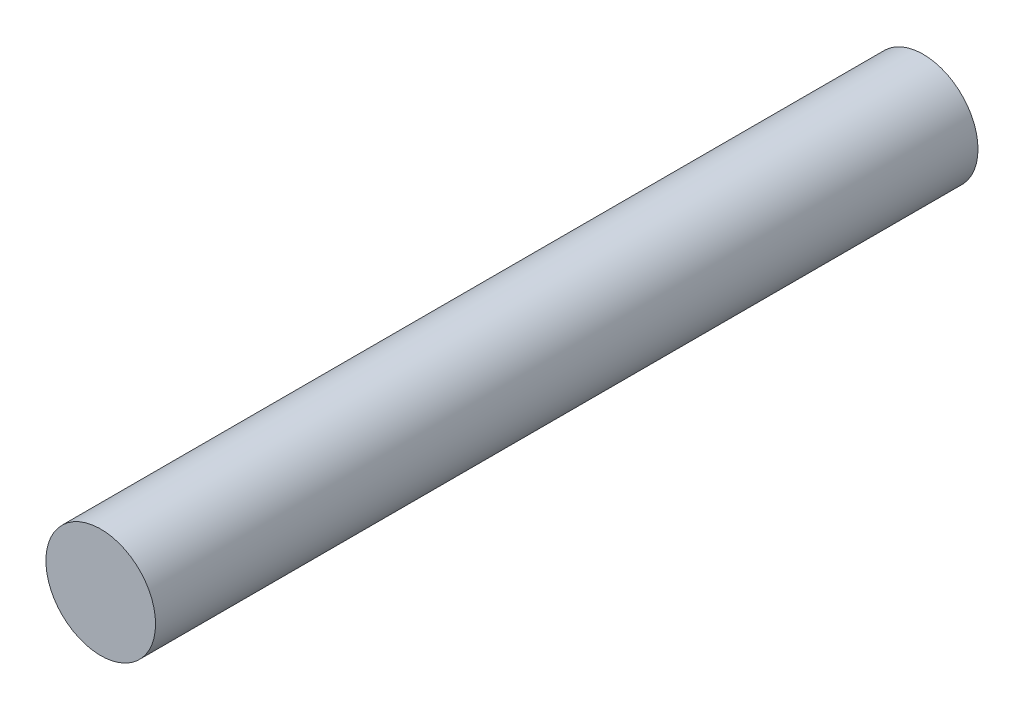
ISO-10303-21;
HEADER;
FILE_DESCRIPTION(('STEP AP214'),'2;1');
FILE_NAME('part.step','',(''),(''),'','','');
FILE_SCHEMA(('AUTOMOTIVE_DESIGN { 1 0 10303 214 1 1 1 1 }'));
ENDSEC;
DATA;
#1=APPLICATION_CONTEXT('core data for automotive mechanical design processes');
#2=APPLICATION_PROTOCOL_DEFINITION('international standard','automotive_design',2000,#1);
#3=PRODUCT_CONTEXT('',#1,'mechanical');
#4=PRODUCT('Part','Part','',(#3));
#5=PRODUCT_RELATED_PRODUCT_CATEGORY('part','',(#4));
#6=PRODUCT_DEFINITION_FORMATION('','',#4);
#7=PRODUCT_DEFINITION_CONTEXT('part definition',#1,'design');
#8=PRODUCT_DEFINITION('design','',#6,#7);
#9=PRODUCT_DEFINITION_SHAPE('','',#8);
#10=(LENGTH_UNIT() NAMED_UNIT(*) SI_UNIT(.MILLI.,.METRE.));
#11=(NAMED_UNIT(*) PLANE_ANGLE_UNIT() SI_UNIT($,.RADIAN.));
#12=(NAMED_UNIT(*) SI_UNIT($,.STERADIAN.) SOLID_ANGLE_UNIT());
#13=UNCERTAINTY_MEASURE_WITH_UNIT(LENGTH_MEASURE(1.E-05),#10,'distance_accuracy_value','');
#14=(GEOMETRIC_REPRESENTATION_CONTEXT(3) GLOBAL_UNCERTAINTY_ASSIGNED_CONTEXT((#13)) GLOBAL_UNIT_ASSIGNED_CONTEXT((#10,
#11,#12)) REPRESENTATION_CONTEXT('',''));
#15=CARTESIAN_POINT('',(0.,0.,0.));
#16=DIRECTION('',(0.,0.,1.));
#17=DIRECTION('',(1.,0.,0.));
#18=AXIS2_PLACEMENT_3D('',#15,#16,#17);
#19=CARTESIAN_POINT('',(0.,0.,30.));
#20=DIRECTION('',(0.,0.,-1.));
#21=DIRECTION('',(-1.,0.,0.));
#22=AXIS2_PLACEMENT_3D('',#19,#20,#21);
#23=CYLINDRICAL_SURFACE('',#22,2.);
#24=CARTESIAN_POINT('',(0.,0.,30.));
#25=DIRECTION('',(0.,0.,1.));
#26=DIRECTION('',(1.,0.,0.));
#27=AXIS2_PLACEMENT_3D('',#24,#25,#26);
#28=CIRCLE('',#27,2.);
#29=CARTESIAN_POINT('',(2.,0.,30.));
#30=VERTEX_POINT('',#29);
#31=EDGE_CURVE('E10',#30,#30,#28,.T.);
#32=ORIENTED_EDGE('',*,*,#31,.F.);
#33=EDGE_LOOP('',(#32));
#34=FACE_BOUND('',#33,.T.);
#35=CARTESIAN_POINT('',(0.,0.,0.));
#36=DIRECTION('',(0.,0.,1.));
#37=DIRECTION('',(1.,0.,0.));
#38=AXIS2_PLACEMENT_3D('',#35,#36,#37);
#39=CIRCLE('',#38,2.);
#40=CARTESIAN_POINT('',(2.,0.,0.));
#41=VERTEX_POINT('',#40);
#42=EDGE_CURVE('E34',#41,#41,#39,.T.);
#43=ORIENTED_EDGE('',*,*,#42,.T.);
#44=EDGE_LOOP('',(#43));
#45=FACE_BOUND('',#44,.T.);
#46=ADVANCED_FACE('F31',(#34,#45),#23,.T.);
#47=CARTESIAN_POINT('',(0.,0.,30.));
#48=DIRECTION('',(0.,0.,1.));
#49=DIRECTION('',(1.,0.,0.));
#50=AXIS2_PLACEMENT_3D('',#47,#48,#49);
#51=PLANE('',#50);
#52=ORIENTED_EDGE('',*,*,#31,.T.);
#53=EDGE_LOOP('',(#52));
#54=FACE_BOUND('',#53,.T.);
#55=ADVANCED_FACE('F46',(#54),#51,.T.);
#56=CARTESIAN_POINT('',(0.,0.,0.));
#57=DIRECTION('',(0.,0.,1.));
#58=DIRECTION('',(1.,0.,0.));
#59=AXIS2_PLACEMENT_3D('',#56,#57,#58);
#60=PLANE('',#59);
#61=ORIENTED_EDGE('',*,*,#42,.F.);
#62=EDGE_LOOP('',(#61));
#63=FACE_BOUND('',#62,.T.);
#64=ADVANCED_FACE('F44',(#63),#60,.F.);
#65=CLOSED_SHELL('',(#46,#55,#64));
#66=MANIFOLD_SOLID_BREP('B2',#65);
#67=ADVANCED_BREP_SHAPE_REPRESENTATION('',(#18,#66),#14);
#68=SHAPE_DEFINITION_REPRESENTATION(#9,#67);
ENDSEC;
END-ISO-10303-21;
